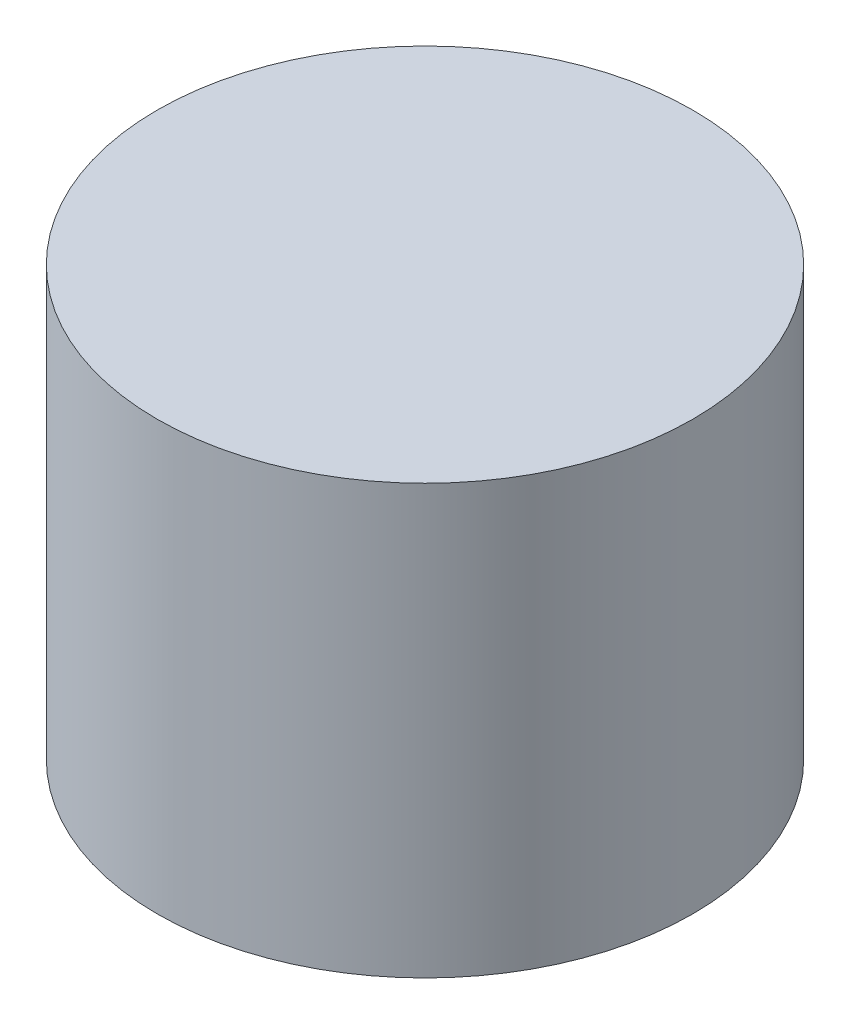
ISO-10303-21;
HEADER;
FILE_DESCRIPTION(('STEP AP214'),'2;1');
FILE_NAME('part.step','',(''),(''),'','','');
FILE_SCHEMA(('AUTOMOTIVE_DESIGN { 1 0 10303 214 1 1 1 1 }'));
ENDSEC;
DATA;
#1=APPLICATION_CONTEXT('core data for automotive mechanical design processes');
#2=APPLICATION_PROTOCOL_DEFINITION('international standard','automotive_design',2000,#1);
#3=PRODUCT_CONTEXT('',#1,'mechanical');
#4=PRODUCT('Part','Part','',(#3));
#5=PRODUCT_RELATED_PRODUCT_CATEGORY('part','',(#4));
#6=PRODUCT_DEFINITION_FORMATION('','',#4);
#7=PRODUCT_DEFINITION_CONTEXT('part definition',#1,'design');
#8=PRODUCT_DEFINITION('design','',#6,#7);
#9=PRODUCT_DEFINITION_SHAPE('','',#8);
#10=(LENGTH_UNIT() NAMED_UNIT(*) SI_UNIT(.MILLI.,.METRE.));
#11=(NAMED_UNIT(*) PLANE_ANGLE_UNIT() SI_UNIT($,.RADIAN.));
#12=(NAMED_UNIT(*) SI_UNIT($,.STERADIAN.) SOLID_ANGLE_UNIT());
#13=UNCERTAINTY_MEASURE_WITH_UNIT(LENGTH_MEASURE(1.E-05),#10,'distance_accuracy_value','');
#14=(GEOMETRIC_REPRESENTATION_CONTEXT(3) GLOBAL_UNCERTAINTY_ASSIGNED_CONTEXT((#13)) GLOBAL_UNIT_ASSIGNED_CONTEXT((#10,
#11,#12)) REPRESENTATION_CONTEXT('',''));
#15=CARTESIAN_POINT('',(0.,0.,0.));
#16=DIRECTION('',(0.,0.,1.));
#17=DIRECTION('',(1.,0.,0.));
#18=AXIS2_PLACEMENT_3D('',#15,#16,#17);
#19=CARTESIAN_POINT('',(0.,101.6,0.));
#20=DIRECTION('',(0.,-1.,0.));
#21=DIRECTION('',(0.,0.,-1.));
#22=AXIS2_PLACEMENT_3D('',#19,#20,#21);
#23=CYLINDRICAL_SURFACE('',#22,63.5);
#24=CARTESIAN_POINT('',(0.,101.6,0.));
#25=DIRECTION('',(0.,1.,0.));
#26=DIRECTION('',(0.,0.,1.));
#27=AXIS2_PLACEMENT_3D('',#24,#25,#26);
#28=CIRCLE('',#27,63.5);
#29=CARTESIAN_POINT('',(0.,101.6,63.5));
#30=VERTEX_POINT('',#29);
#31=EDGE_CURVE('E10',#30,#30,#28,.T.);
#32=ORIENTED_EDGE('',*,*,#31,.F.);
#33=EDGE_LOOP('',(#32));
#34=FACE_BOUND('',#33,.T.);
#35=CARTESIAN_POINT('',(0.,0.,0.));
#36=DIRECTION('',(0.,1.,0.));
#37=DIRECTION('',(0.,0.,1.));
#38=AXIS2_PLACEMENT_3D('',#35,#36,#37);
#39=CIRCLE('',#38,63.5);
#40=CARTESIAN_POINT('',(0.,0.,63.5));
#41=VERTEX_POINT('',#40);
#42=EDGE_CURVE('E34',#41,#41,#39,.T.);
#43=ORIENTED_EDGE('',*,*,#42,.T.);
#44=EDGE_LOOP('',(#43));
#45=FACE_BOUND('',#44,.T.);
#46=ADVANCED_FACE('F31',(#34,#45),#23,.T.);
#47=CARTESIAN_POINT('',(0.,101.6,0.));
#48=DIRECTION('',(0.,1.,0.));
#49=DIRECTION('',(0.,0.,1.));
#50=AXIS2_PLACEMENT_3D('',#47,#48,#49);
#51=PLANE('',#50);
#52=ORIENTED_EDGE('',*,*,#31,.T.);
#53=EDGE_LOOP('',(#52));
#54=FACE_BOUND('',#53,.T.);
#55=ADVANCED_FACE('F46',(#54),#51,.T.);
#56=CARTESIAN_POINT('',(0.,0.,0.));
#57=DIRECTION('',(0.,1.,0.));
#58=DIRECTION('',(0.,0.,1.));
#59=AXIS2_PLACEMENT_3D('',#56,#57,#58);
#60=PLANE('',#59);
#61=ORIENTED_EDGE('',*,*,#42,.F.);
#62=EDGE_LOOP('',(#61));
#63=FACE_BOUND('',#62,.T.);
#64=ADVANCED_FACE('F44',(#63),#60,.F.);
#65=CLOSED_SHELL('',(#46,#55,#64));
#66=MANIFOLD_SOLID_BREP('B2',#65);
#67=ADVANCED_BREP_SHAPE_REPRESENTATION('',(#18,#66),#14);
#68=SHAPE_DEFINITION_REPRESENTATION(#9,#67);
ENDSEC;
END-ISO-10303-21;
